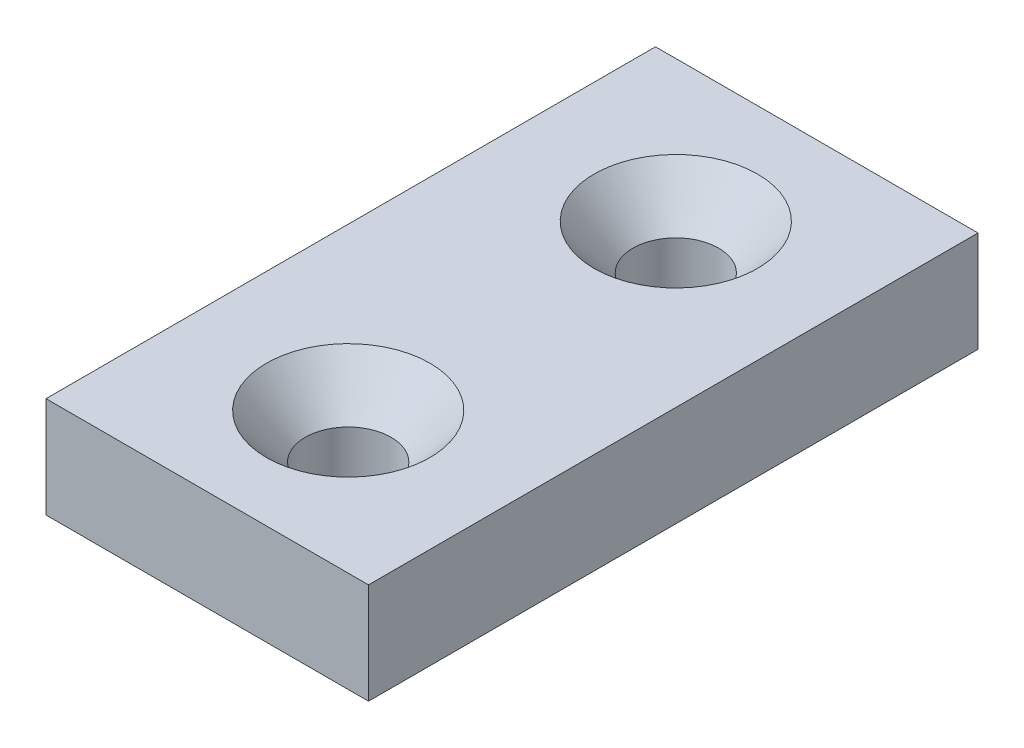
ISO-10303-21;
HEADER;
FILE_DESCRIPTION(('STEP AP214'),'2;1');
FILE_NAME('part.step','',(''),(''),'','','');
FILE_SCHEMA(('AUTOMOTIVE_DESIGN { 1 0 10303 214 1 1 1 1 }'));
ENDSEC;
DATA;
#1=APPLICATION_CONTEXT('core data for automotive mechanical design processes');
#2=APPLICATION_PROTOCOL_DEFINITION('international standard','automotive_design',2000,#1);
#3=PRODUCT_CONTEXT('',#1,'mechanical');
#4=PRODUCT('Part','Part','',(#3));
#5=PRODUCT_RELATED_PRODUCT_CATEGORY('part','',(#4));
#6=PRODUCT_DEFINITION_FORMATION('','',#4);
#7=PRODUCT_DEFINITION_CONTEXT('part definition',#1,'design');
#8=PRODUCT_DEFINITION('design','',#6,#7);
#9=PRODUCT_DEFINITION_SHAPE('','',#8);
#10=(LENGTH_UNIT() NAMED_UNIT(*) SI_UNIT(.MILLI.,.METRE.));
#11=(NAMED_UNIT(*) PLANE_ANGLE_UNIT() SI_UNIT($,.RADIAN.));
#12=(NAMED_UNIT(*) SI_UNIT($,.STERADIAN.) SOLID_ANGLE_UNIT());
#13=UNCERTAINTY_MEASURE_WITH_UNIT(LENGTH_MEASURE(1.E-05),#10,'distance_accuracy_value','');
#14=(GEOMETRIC_REPRESENTATION_CONTEXT(3) GLOBAL_UNCERTAINTY_ASSIGNED_CONTEXT((#13)) GLOBAL_UNIT_ASSIGNED_CONTEXT((#10,
#11,#12)) REPRESENTATION_CONTEXT('',''));
#15=CARTESIAN_POINT('',(0.,0.,0.));
#16=DIRECTION('',(0.,0.,1.));
#17=DIRECTION('',(1.,0.,0.));
#18=AXIS2_PLACEMENT_3D('',#15,#16,#17);
#19=CARTESIAN_POINT('',(-12.7,3.96875,24.));
#20=DIRECTION('',(1.,0.,0.));
#21=DIRECTION('',(0.,0.,-1.));
#22=AXIS2_PLACEMENT_3D('',#19,#20,#21);
#23=PLANE('',#22);
#24=DIRECTION('',(0.,-1.,0.));
#25=VECTOR('',#24,1.);
#26=CARTESIAN_POINT('',(-12.7,3.96875,-24.));
#27=LINE('',#26,#25);
#28=CARTESIAN_POINT('',(-12.7,3.96875,-24.));
#29=VERTEX_POINT('',#28);
#30=CARTESIAN_POINT('',(-12.7,-3.96875,-24.));
#31=VERTEX_POINT('',#30);
#32=EDGE_CURVE('E107',#29,#31,#27,.T.);
#33=ORIENTED_EDGE('',*,*,#32,.T.);
#34=DIRECTION('',(0.,0.,-1.));
#35=VECTOR('',#34,1.);
#36=CARTESIAN_POINT('',(-12.7,-3.96875,24.));
#37=LINE('',#36,#35);
#38=CARTESIAN_POINT('',(-12.7,-3.96875,24.));
#39=VERTEX_POINT('',#38);
#40=EDGE_CURVE('E11',#39,#31,#37,.T.);
#41=ORIENTED_EDGE('',*,*,#40,.F.);
#42=DIRECTION('',(0.,-1.,0.));
#43=VECTOR('',#42,1.);
#44=CARTESIAN_POINT('',(-12.7,3.96875,24.));
#45=LINE('',#44,#43);
#46=CARTESIAN_POINT('',(-12.7,3.96875,24.));
#47=VERTEX_POINT('',#46);
#48=EDGE_CURVE('E91',#47,#39,#45,.T.);
#49=ORIENTED_EDGE('',*,*,#48,.F.);
#50=DIRECTION('',(0.,0.,-1.));
#51=VECTOR('',#50,1.);
#52=CARTESIAN_POINT('',(-12.7,3.96875,24.));
#53=LINE('',#52,#51);
#54=EDGE_CURVE('E103',#47,#29,#53,.T.);
#55=ORIENTED_EDGE('',*,*,#54,.T.);
#56=EDGE_LOOP('',(#33,#41,#49,#55));
#57=FACE_BOUND('',#56,.T.);
#58=ADVANCED_FACE('F39',(#57),#23,.F.);
#59=CARTESIAN_POINT('',(12.7,-3.96875,24.));
#60=DIRECTION('',(0.,1.,0.));
#61=DIRECTION('',(0.,0.,1.));
#62=AXIS2_PLACEMENT_3D('',#59,#60,#61);
#63=PLANE('',#62);
#64=CARTESIAN_POINT('',(0.,-3.96875,12.8999999999999));
#65=DIRECTION('',(0.,1.,0.));
#66=DIRECTION('',(0.,0.,1.));
#67=AXIS2_PLACEMENT_3D('',#64,#65,#66);
#68=CIRCLE('',#67,3.37819999999999);
#69=CARTESIAN_POINT('',(0.,-3.96875,16.2781999999999));
#70=VERTEX_POINT('',#69);
#71=EDGE_CURVE('E139',#70,#70,#68,.T.);
#72=ORIENTED_EDGE('',*,*,#71,.T.);
#73=EDGE_LOOP('',(#72));
#74=FACE_BOUND('',#73,.T.);
#75=CARTESIAN_POINT('',(0.,-3.96875,-12.9));
#76=DIRECTION('',(0.,1.,0.));
#77=DIRECTION('',(0.,0.,1.));
#78=AXIS2_PLACEMENT_3D('',#75,#76,#77);
#79=CIRCLE('',#78,3.37819999999999);
#80=CARTESIAN_POINT('',(0.,-3.96875,-9.52180000000001));
#81=VERTEX_POINT('',#80);
#82=EDGE_CURVE('E111',#81,#81,#79,.T.);
#83=ORIENTED_EDGE('',*,*,#82,.T.);
#84=EDGE_LOOP('',(#83));
#85=FACE_BOUND('',#84,.T.);
#86=DIRECTION('',(1.,0.,0.));
#87=VECTOR('',#86,1.);
#88=CARTESIAN_POINT('',(12.7,-3.96875,-24.));
#89=LINE('',#88,#87);
#90=CARTESIAN_POINT('',(12.7,-3.96875,-24.));
#91=VERTEX_POINT('',#90);
#92=EDGE_CURVE('E96',#31,#91,#89,.T.);
#93=ORIENTED_EDGE('',*,*,#92,.T.);
#94=DIRECTION('',(0.,0.,-1.));
#95=VECTOR('',#94,1.);
#96=CARTESIAN_POINT('',(12.7,-3.96875,24.));
#97=LINE('',#96,#95);
#98=CARTESIAN_POINT('',(12.7,-3.96875,24.));
#99=VERTEX_POINT('',#98);
#100=EDGE_CURVE('E48',#99,#91,#97,.T.);
#101=ORIENTED_EDGE('',*,*,#100,.F.);
#102=DIRECTION('',(1.,0.,0.));
#103=VECTOR('',#102,1.);
#104=CARTESIAN_POINT('',(12.7,-3.96875,24.));
#105=LINE('',#104,#103);
#106=EDGE_CURVE('E86',#39,#99,#105,.T.);
#107=ORIENTED_EDGE('',*,*,#106,.F.);
#108=ORIENTED_EDGE('',*,*,#40,.T.);
#109=EDGE_LOOP('',(#93,#101,#107,#108));
#110=FACE_BOUND('',#109,.T.);
#111=ADVANCED_FACE('F95',(#74,#85,#110),#63,.F.);
#112=CARTESIAN_POINT('',(12.7,3.96875,24.));
#113=DIRECTION('',(-1.,0.,0.));
#114=DIRECTION('',(0.,0.,1.));
#115=AXIS2_PLACEMENT_3D('',#112,#113,#114);
#116=PLANE('',#115);
#117=DIRECTION('',(0.,1.,0.));
#118=VECTOR('',#117,1.);
#119=CARTESIAN_POINT('',(12.7,3.96875,-24.));
#120=LINE('',#119,#118);
#121=CARTESIAN_POINT('',(12.7,3.96875,-24.));
#122=VERTEX_POINT('',#121);
#123=EDGE_CURVE('E73',#91,#122,#120,.T.);
#124=ORIENTED_EDGE('',*,*,#123,.T.);
#125=DIRECTION('',(0.,0.,-1.));
#126=VECTOR('',#125,1.);
#127=CARTESIAN_POINT('',(12.7,3.96875,24.));
#128=LINE('',#127,#126);
#129=CARTESIAN_POINT('',(12.7,3.96875,24.));
#130=VERTEX_POINT('',#129);
#131=EDGE_CURVE('E98',#130,#122,#128,.T.);
#132=ORIENTED_EDGE('',*,*,#131,.F.);
#133=DIRECTION('',(0.,1.,0.));
#134=VECTOR('',#133,1.);
#135=CARTESIAN_POINT('',(12.7,3.96875,24.));
#136=LINE('',#135,#134);
#137=EDGE_CURVE('E89',#99,#130,#136,.T.);
#138=ORIENTED_EDGE('',*,*,#137,.F.);
#139=ORIENTED_EDGE('',*,*,#100,.T.);
#140=EDGE_LOOP('',(#124,#132,#138,#139));
#141=FACE_BOUND('',#140,.T.);
#142=ADVANCED_FACE('F99',(#141),#116,.F.);
#143=CARTESIAN_POINT('',(12.7,3.96875,24.));
#144=DIRECTION('',(0.,-1.,0.));
#145=DIRECTION('',(0.,0.,-1.));
#146=AXIS2_PLACEMENT_3D('',#143,#144,#145);
#147=PLANE('',#146);
#148=CARTESIAN_POINT('',(0.,3.96875,12.8999999999999));
#149=DIRECTION('',(0.,1.,0.));
#150=DIRECTION('',(0.,0.,1.));
#151=AXIS2_PLACEMENT_3D('',#148,#149,#150);
#152=CIRCLE('',#151,6.4389);
#153=CARTESIAN_POINT('',(0.,3.96875,19.3388999999999));
#154=VERTEX_POINT('',#153);
#155=EDGE_CURVE('E147',#154,#154,#152,.T.);
#156=ORIENTED_EDGE('',*,*,#155,.F.);
#157=EDGE_LOOP('',(#156));
#158=FACE_BOUND('',#157,.T.);
#159=CARTESIAN_POINT('',(0.,3.96875,-12.9));
#160=DIRECTION('',(0.,1.,0.));
#161=DIRECTION('',(0.,0.,1.));
#162=AXIS2_PLACEMENT_3D('',#159,#160,#161);
#163=CIRCLE('',#162,6.4389);
#164=CARTESIAN_POINT('',(0.,3.96875,-6.46109999999999));
#165=VERTEX_POINT('',#164);
#166=EDGE_CURVE('E135',#165,#165,#163,.T.);
#167=ORIENTED_EDGE('',*,*,#166,.F.);
#168=EDGE_LOOP('',(#167));
#169=FACE_BOUND('',#168,.T.);
#170=DIRECTION('',(-1.,0.,0.));
#171=VECTOR('',#170,1.);
#172=CARTESIAN_POINT('',(12.7,3.96875,-24.));
#173=LINE('',#172,#171);
#174=EDGE_CURVE('E79',#122,#29,#173,.T.);
#175=ORIENTED_EDGE('',*,*,#174,.T.);
#176=ORIENTED_EDGE('',*,*,#54,.F.);
#177=DIRECTION('',(-1.,0.,0.));
#178=VECTOR('',#177,1.);
#179=CARTESIAN_POINT('',(12.7,3.96875,24.));
#180=LINE('',#179,#178);
#181=EDGE_CURVE('E56',#130,#47,#180,.T.);
#182=ORIENTED_EDGE('',*,*,#181,.F.);
#183=ORIENTED_EDGE('',*,*,#131,.T.);
#184=EDGE_LOOP('',(#175,#176,#182,#183));
#185=FACE_BOUND('',#184,.T.);
#186=ADVANCED_FACE('F121',(#158,#169,#185),#147,.F.);
#187=CARTESIAN_POINT('',(0.,0.,24.));
#188=DIRECTION('',(0.,0.,-1.));
#189=DIRECTION('',(-1.,0.,0.));
#190=AXIS2_PLACEMENT_3D('',#187,#188,#189);
#191=PLANE('',#190);
#192=ORIENTED_EDGE('',*,*,#48,.T.);
#193=ORIENTED_EDGE('',*,*,#106,.T.);
#194=ORIENTED_EDGE('',*,*,#137,.T.);
#195=ORIENTED_EDGE('',*,*,#181,.T.);
#196=EDGE_LOOP('',(#192,#193,#194,#195));
#197=FACE_BOUND('',#196,.T.);
#198=ADVANCED_FACE('F87',(#197),#191,.F.);
#199=CARTESIAN_POINT('',(0.,0.,-24.));
#200=DIRECTION('',(0.,0.,-1.));
#201=DIRECTION('',(-1.,0.,0.));
#202=AXIS2_PLACEMENT_3D('',#199,#200,#201);
#203=PLANE('',#202);
#204=ORIENTED_EDGE('',*,*,#32,.F.);
#205=ORIENTED_EDGE('',*,*,#174,.F.);
#206=ORIENTED_EDGE('',*,*,#123,.F.);
#207=ORIENTED_EDGE('',*,*,#92,.F.);
#208=EDGE_LOOP('',(#204,#205,#206,#207));
#209=FACE_BOUND('',#208,.T.);
#210=ADVANCED_FACE('F124',(#209),#203,.T.);
#211=CARTESIAN_POINT('',(0.,3.96875,-12.9));
#212=DIRECTION('',(0.,1.,0.));
#213=DIRECTION('',(0.,0.,1.));
#214=AXIS2_PLACEMENT_3D('',#211,#212,#213);
#215=CYLINDRICAL_SURFACE('',#214,3.37819999999999);
#216=ORIENTED_EDGE('',*,*,#82,.F.);
#217=EDGE_LOOP('',(#216));
#218=FACE_BOUND('',#217,.T.);
#219=CARTESIAN_POINT('',(0.,0.447817416018657,-12.9));
#220=DIRECTION('',(0.,1.,0.));
#221=DIRECTION('',(0.,0.,1.));
#222=AXIS2_PLACEMENT_3D('',#219,#220,#221);
#223=CIRCLE('',#222,3.3782);
#224=CARTESIAN_POINT('',(0.,0.447817416018657,-9.52179999999999));
#225=VERTEX_POINT('',#224);
#226=EDGE_CURVE('E131',#225,#225,#223,.T.);
#227=ORIENTED_EDGE('',*,*,#226,.T.);
#228=EDGE_LOOP('',(#227));
#229=FACE_BOUND('',#228,.T.);
#230=ADVANCED_FACE('F162',(#218,#229),#215,.F.);
#231=CARTESIAN_POINT('',(0.,3.96875,-12.9));
#232=DIRECTION('',(0.,1.,0.));
#233=DIRECTION('',(0.,0.,1.));
#234=AXIS2_PLACEMENT_3D('',#231,#232,#233);
#235=CONICAL_SURFACE('',#234,6.4389,0.715584993317675);
#236=ORIENTED_EDGE('',*,*,#226,.F.);
#237=EDGE_LOOP('',(#236));
#238=FACE_BOUND('',#237,.T.);
#239=ORIENTED_EDGE('',*,*,#166,.T.);
#240=EDGE_LOOP('',(#239));
#241=FACE_BOUND('',#240,.T.);
#242=ADVANCED_FACE('F159',(#238,#241),#235,.F.);
#243=CARTESIAN_POINT('',(0.,3.96875,12.8999999999999));
#244=DIRECTION('',(0.,1.,0.));
#245=DIRECTION('',(0.,0.,1.));
#246=AXIS2_PLACEMENT_3D('',#243,#244,#245);
#247=CYLINDRICAL_SURFACE('',#246,3.37819999999999);
#248=ORIENTED_EDGE('',*,*,#71,.F.);
#249=EDGE_LOOP('',(#248));
#250=FACE_BOUND('',#249,.T.);
#251=CARTESIAN_POINT('',(0.,0.447817416018657,12.8999999999999));
#252=DIRECTION('',(0.,1.,0.));
#253=DIRECTION('',(0.,0.,1.));
#254=AXIS2_PLACEMENT_3D('',#251,#252,#253);
#255=CIRCLE('',#254,3.3782);
#256=CARTESIAN_POINT('',(0.,0.447817416018657,16.2781999999999));
#257=VERTEX_POINT('',#256);
#258=EDGE_CURVE('E143',#257,#257,#255,.T.);
#259=ORIENTED_EDGE('',*,*,#258,.T.);
#260=EDGE_LOOP('',(#259));
#261=FACE_BOUND('',#260,.T.);
#262=ADVANCED_FACE('F161',(#250,#261),#247,.F.);
#263=CARTESIAN_POINT('',(0.,3.96875,12.8999999999999));
#264=DIRECTION('',(0.,1.,0.));
#265=DIRECTION('',(0.,0.,1.));
#266=AXIS2_PLACEMENT_3D('',#263,#264,#265);
#267=CONICAL_SURFACE('',#266,6.4389,0.715584993317675);
#268=ORIENTED_EDGE('',*,*,#258,.F.);
#269=EDGE_LOOP('',(#268));
#270=FACE_BOUND('',#269,.T.);
#271=ORIENTED_EDGE('',*,*,#155,.T.);
#272=EDGE_LOOP('',(#271));
#273=FACE_BOUND('',#272,.T.);
#274=ADVANCED_FACE('F152',(#270,#273),#267,.F.);
#275=CLOSED_SHELL('',(#58,#111,#142,#186,#198,#210,#230,#242,#262,#274));
#276=MANIFOLD_SOLID_BREP('B2',#275);
#277=ADVANCED_BREP_SHAPE_REPRESENTATION('',(#18,#276),#14);
#278=SHAPE_DEFINITION_REPRESENTATION(#9,#277);
ENDSEC;
END-ISO-10303-21;
